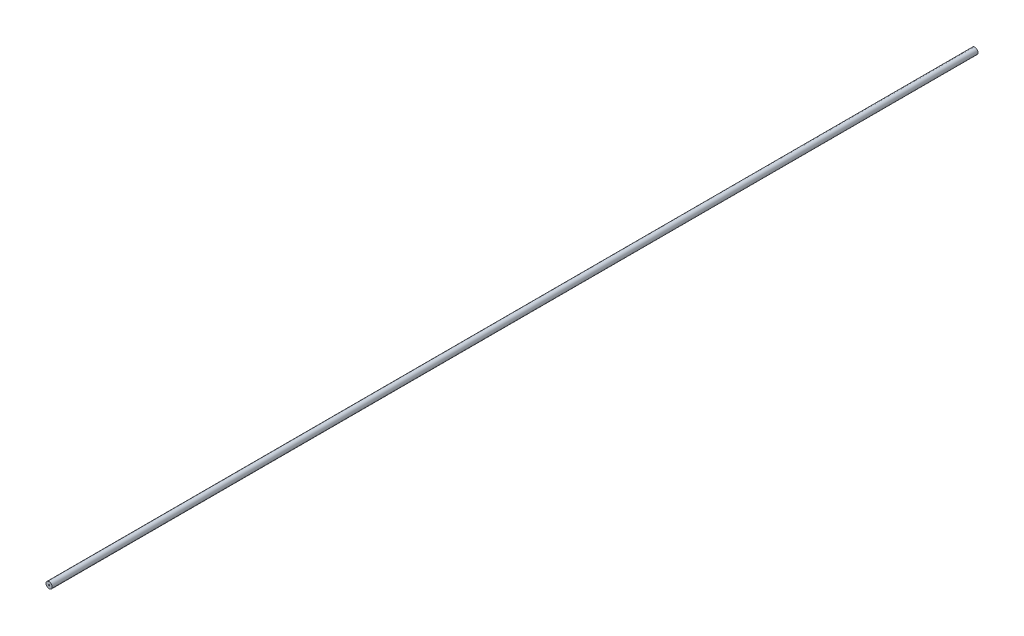
ISO-10303-21;
HEADER;
FILE_DESCRIPTION(('STEP AP214'),'2;1');
FILE_NAME('part.step','',(''),(''),'','','');
FILE_SCHEMA(('AUTOMOTIVE_DESIGN { 1 0 10303 214 1 1 1 1 }'));
ENDSEC;
DATA;
#1=APPLICATION_CONTEXT('core data for automotive mechanical design processes');
#2=APPLICATION_PROTOCOL_DEFINITION('international standard','automotive_design',2000,#1);
#3=PRODUCT_CONTEXT('',#1,'mechanical');
#4=PRODUCT('Part','Part','',(#3));
#5=PRODUCT_RELATED_PRODUCT_CATEGORY('part','',(#4));
#6=PRODUCT_DEFINITION_FORMATION('','',#4);
#7=PRODUCT_DEFINITION_CONTEXT('part definition',#1,'design');
#8=PRODUCT_DEFINITION('design','',#6,#7);
#9=PRODUCT_DEFINITION_SHAPE('','',#8);
#10=(LENGTH_UNIT() NAMED_UNIT(*) SI_UNIT(.MILLI.,.METRE.));
#11=(NAMED_UNIT(*) PLANE_ANGLE_UNIT() SI_UNIT($,.RADIAN.));
#12=(NAMED_UNIT(*) SI_UNIT($,.STERADIAN.) SOLID_ANGLE_UNIT());
#13=UNCERTAINTY_MEASURE_WITH_UNIT(LENGTH_MEASURE(1.E-05),#10,'distance_accuracy_value','');
#14=(GEOMETRIC_REPRESENTATION_CONTEXT(3) GLOBAL_UNCERTAINTY_ASSIGNED_CONTEXT((#13)) GLOBAL_UNIT_ASSIGNED_CONTEXT((#10,
#11,#12)) REPRESENTATION_CONTEXT('',''));
#15=CARTESIAN_POINT('',(0.,0.,0.));
#16=DIRECTION('',(0.,0.,1.));
#17=DIRECTION('',(1.,0.,0.));
#18=AXIS2_PLACEMENT_3D('',#15,#16,#17);
#19=CARTESIAN_POINT('',(0.,0.,408.822965385198));
#20=DIRECTION('',(0.,0.,1.));
#21=DIRECTION('',(1.,0.,0.));
#22=AXIS2_PLACEMENT_3D('',#19,#20,#21);
#23=PLANE('',#22);
#24=CARTESIAN_POINT('',(0.,0.,408.822965385198));
#25=DIRECTION('',(0.,0.,1.));
#26=DIRECTION('',(1.,0.,0.));
#27=AXIS2_PLACEMENT_3D('',#24,#25,#26);
#28=CIRCLE('',#27,2.75);
#29=CARTESIAN_POINT('',(2.75,0.,408.822965385198));
#30=VERTEX_POINT('',#29);
#31=EDGE_CURVE('E10',#30,#30,#28,.T.);
#32=ORIENTED_EDGE('',*,*,#31,.T.);
#33=EDGE_LOOP('',(#32));
#34=FACE_BOUND('',#33,.T.);
#35=CARTESIAN_POINT('',(0.,0.,408.822965385198));
#36=DIRECTION('',(0.,0.,1.));
#37=DIRECTION('',(1.,0.,0.));
#38=AXIS2_PLACEMENT_3D('',#35,#36,#37);
#39=CIRCLE('',#38,0.5);
#40=CARTESIAN_POINT('',(0.5,0.,408.822965385198));
#41=VERTEX_POINT('',#40);
#42=EDGE_CURVE('E44',#41,#41,#39,.T.);
#43=ORIENTED_EDGE('',*,*,#42,.F.);
#44=EDGE_LOOP('',(#43));
#45=FACE_BOUND('',#44,.T.);
#46=ADVANCED_FACE('F33',(#34,#45),#23,.T.);
#47=CARTESIAN_POINT('',(0.,0.,-408.822965385198));
#48=DIRECTION('',(0.,0.,1.));
#49=DIRECTION('',(1.,0.,0.));
#50=AXIS2_PLACEMENT_3D('',#47,#48,#49);
#51=PLANE('',#50);
#52=CARTESIAN_POINT('',(0.,0.,-408.822965385198));
#53=DIRECTION('',(0.,0.,1.));
#54=DIRECTION('',(1.,0.,0.));
#55=AXIS2_PLACEMENT_3D('',#52,#53,#54);
#56=CIRCLE('',#55,2.75);
#57=CARTESIAN_POINT('',(2.75,0.,-408.822965385198));
#58=VERTEX_POINT('',#57);
#59=EDGE_CURVE('E37',#58,#58,#56,.T.);
#60=ORIENTED_EDGE('',*,*,#59,.F.);
#61=EDGE_LOOP('',(#60));
#62=FACE_BOUND('',#61,.T.);
#63=CARTESIAN_POINT('',(0.,0.,-408.822965385198));
#64=DIRECTION('',(0.,0.,1.));
#65=DIRECTION('',(1.,0.,0.));
#66=AXIS2_PLACEMENT_3D('',#63,#64,#65);
#67=CIRCLE('',#66,0.5);
#68=CARTESIAN_POINT('',(0.5,0.,-408.822965385198));
#69=VERTEX_POINT('',#68);
#70=EDGE_CURVE('E46',#69,#69,#67,.T.);
#71=ORIENTED_EDGE('',*,*,#70,.T.);
#72=EDGE_LOOP('',(#71));
#73=FACE_BOUND('',#72,.T.);
#74=ADVANCED_FACE('F56',(#62,#73),#51,.F.);
#75=CARTESIAN_POINT('',(0.,0.,408.822965385198));
#76=DIRECTION('',(0.,0.,-1.));
#77=DIRECTION('',(-1.,0.,0.));
#78=AXIS2_PLACEMENT_3D('',#75,#76,#77);
#79=CYLINDRICAL_SURFACE('',#78,2.75);
#80=ORIENTED_EDGE('',*,*,#31,.F.);
#81=EDGE_LOOP('',(#80));
#82=FACE_BOUND('',#81,.T.);
#83=ORIENTED_EDGE('',*,*,#59,.T.);
#84=EDGE_LOOP('',(#83));
#85=FACE_BOUND('',#84,.T.);
#86=ADVANCED_FACE('F35',(#82,#85),#79,.T.);
#87=CARTESIAN_POINT('',(0.,0.,408.822965385198));
#88=DIRECTION('',(0.,0.,-1.));
#89=DIRECTION('',(-1.,0.,0.));
#90=AXIS2_PLACEMENT_3D('',#87,#88,#89);
#91=CYLINDRICAL_SURFACE('',#90,0.5);
#92=ORIENTED_EDGE('',*,*,#42,.T.);
#93=EDGE_LOOP('',(#92));
#94=FACE_BOUND('',#93,.T.);
#95=ORIENTED_EDGE('',*,*,#70,.F.);
#96=EDGE_LOOP('',(#95));
#97=FACE_BOUND('',#96,.T.);
#98=ADVANCED_FACE('F52',(#94,#97),#91,.F.);
#99=CLOSED_SHELL('',(#46,#74,#86,#98));
#100=MANIFOLD_SOLID_BREP('B2',#99);
#101=ADVANCED_BREP_SHAPE_REPRESENTATION('',(#18,#100),#14);
#102=SHAPE_DEFINITION_REPRESENTATION(#9,#101);
ENDSEC;
END-ISO-10303-21;
